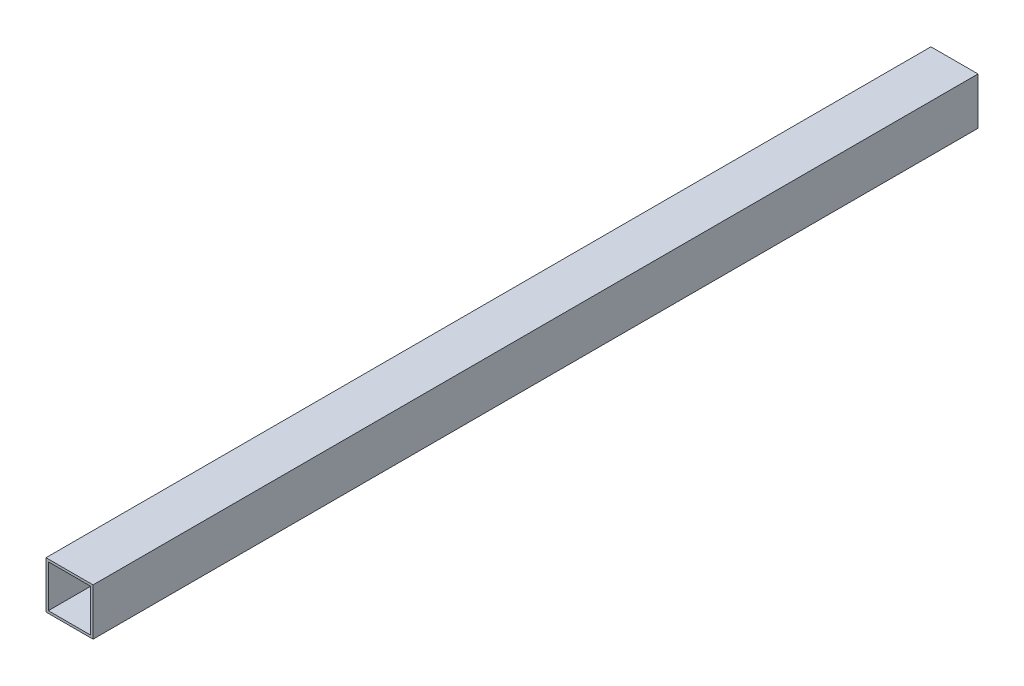
ISO-10303-21;
HEADER;
FILE_DESCRIPTION(('STEP AP214'),'2;1');
FILE_NAME('part.step','',(''),(''),'','','');
FILE_SCHEMA(('AUTOMOTIVE_DESIGN { 1 0 10303 214 1 1 1 1 }'));
ENDSEC;
DATA;
#1=APPLICATION_CONTEXT('core data for automotive mechanical design processes');
#2=APPLICATION_PROTOCOL_DEFINITION('international standard','automotive_design',2000,#1);
#3=PRODUCT_CONTEXT('',#1,'mechanical');
#4=PRODUCT('Part','Part','',(#3));
#5=PRODUCT_RELATED_PRODUCT_CATEGORY('part','',(#4));
#6=PRODUCT_DEFINITION_FORMATION('','',#4);
#7=PRODUCT_DEFINITION_CONTEXT('part definition',#1,'design');
#8=PRODUCT_DEFINITION('design','',#6,#7);
#9=PRODUCT_DEFINITION_SHAPE('','',#8);
#10=(LENGTH_UNIT() NAMED_UNIT(*) SI_UNIT(.MILLI.,.METRE.));
#11=(NAMED_UNIT(*) PLANE_ANGLE_UNIT() SI_UNIT($,.RADIAN.));
#12=(NAMED_UNIT(*) SI_UNIT($,.STERADIAN.) SOLID_ANGLE_UNIT());
#13=UNCERTAINTY_MEASURE_WITH_UNIT(LENGTH_MEASURE(1.E-05),#10,'distance_accuracy_value','');
#14=(GEOMETRIC_REPRESENTATION_CONTEXT(3) GLOBAL_UNCERTAINTY_ASSIGNED_CONTEXT((#13)) GLOBAL_UNIT_ASSIGNED_CONTEXT((#10,
#11,#12)) REPRESENTATION_CONTEXT('',''));
#15=CARTESIAN_POINT('',(0.,0.,0.));
#16=DIRECTION('',(0.,0.,1.));
#17=DIRECTION('',(1.,0.,0.));
#18=AXIS2_PLACEMENT_3D('',#15,#16,#17);
#19=CARTESIAN_POINT('',(0.,0.,940.));
#20=DIRECTION('',(0.,0.,-1.));
#21=DIRECTION('',(-1.,0.,0.));
#22=AXIS2_PLACEMENT_3D('',#19,#20,#21);
#23=PLANE('',#22);
#24=DIRECTION('',(0.,-1.,0.));
#25=VECTOR('',#24,1.);
#26=CARTESIAN_POINT('',(-50.,-50.,940.));
#27=LINE('',#26,#25);
#28=CARTESIAN_POINT('',(-50.,49.9999999999999,940.));
#29=VERTEX_POINT('',#28);
#30=CARTESIAN_POINT('',(-50.,-50.,940.));
#31=VERTEX_POINT('',#30);
#32=EDGE_CURVE('E139',#29,#31,#27,.T.);
#33=ORIENTED_EDGE('',*,*,#32,.T.);
#34=DIRECTION('',(1.,0.,0.));
#35=VECTOR('',#34,1.);
#36=CARTESIAN_POINT('',(-50.,-50.,940.));
#37=LINE('',#36,#35);
#38=CARTESIAN_POINT('',(50.,-50.,940.));
#39=VERTEX_POINT('',#38);
#40=EDGE_CURVE('E141',#31,#39,#37,.T.);
#41=ORIENTED_EDGE('',*,*,#40,.T.);
#42=DIRECTION('',(0.,1.,0.));
#43=VECTOR('',#42,1.);
#44=CARTESIAN_POINT('',(50.,-50.,940.));
#45=LINE('',#44,#43);
#46=CARTESIAN_POINT('',(49.9999999999999,49.9999999999999,940.));
#47=VERTEX_POINT('',#46);
#48=EDGE_CURVE('E148',#39,#47,#45,.T.);
#49=ORIENTED_EDGE('',*,*,#48,.T.);
#50=DIRECTION('',(-1.,0.,0.));
#51=VECTOR('',#50,1.);
#52=CARTESIAN_POINT('',(-50.,49.9999999999999,940.));
#53=LINE('',#52,#51);
#54=EDGE_CURVE('E146',#47,#29,#53,.T.);
#55=ORIENTED_EDGE('',*,*,#54,.T.);
#56=EDGE_LOOP('',(#33,#41,#49,#55));
#57=FACE_BOUND('',#56,.T.);
#58=DIRECTION('',(0.,-1.,0.));
#59=VECTOR('',#58,1.);
#60=CARTESIAN_POINT('',(-45.,-45.,940.));
#61=LINE('',#60,#59);
#62=CARTESIAN_POINT('',(-45.,44.9999999999999,940.));
#63=VERTEX_POINT('',#62);
#64=CARTESIAN_POINT('',(-45.,-45.,940.));
#65=VERTEX_POINT('',#64);
#66=EDGE_CURVE('E102',#63,#65,#61,.T.);
#67=ORIENTED_EDGE('',*,*,#66,.F.);
#68=DIRECTION('',(-1.,0.,0.));
#69=VECTOR('',#68,1.);
#70=CARTESIAN_POINT('',(-45.,44.9999999999999,940.));
#71=LINE('',#70,#69);
#72=CARTESIAN_POINT('',(45.,44.9999999999999,940.));
#73=VERTEX_POINT('',#72);
#74=EDGE_CURVE('E127',#73,#63,#71,.T.);
#75=ORIENTED_EDGE('',*,*,#74,.F.);
#76=DIRECTION('',(0.,1.,0.));
#77=VECTOR('',#76,1.);
#78=CARTESIAN_POINT('',(45.,-45.,940.));
#79=LINE('',#78,#77);
#80=CARTESIAN_POINT('',(45.,-45.,940.));
#81=VERTEX_POINT('',#80);
#82=EDGE_CURVE('E121',#81,#73,#79,.T.);
#83=ORIENTED_EDGE('',*,*,#82,.F.);
#84=DIRECTION('',(1.,0.,0.));
#85=VECTOR('',#84,1.);
#86=CARTESIAN_POINT('',(-45.,-45.,940.));
#87=LINE('',#86,#85);
#88=EDGE_CURVE('E115',#65,#81,#87,.T.);
#89=ORIENTED_EDGE('',*,*,#88,.F.);
#90=EDGE_LOOP('',(#67,#75,#83,#89));
#91=FACE_BOUND('',#90,.T.);
#92=ADVANCED_FACE('F39',(#57,#91),#23,.F.);
#93=CARTESIAN_POINT('',(0.,0.,-940.));
#94=DIRECTION('',(0.,0.,-1.));
#95=DIRECTION('',(-1.,0.,0.));
#96=AXIS2_PLACEMENT_3D('',#93,#94,#95);
#97=PLANE('',#96);
#98=DIRECTION('',(0.,-1.,0.));
#99=VECTOR('',#98,1.);
#100=CARTESIAN_POINT('',(-50.,-50.,-940.));
#101=LINE('',#100,#99);
#102=CARTESIAN_POINT('',(-50.,49.9999999999999,-940.));
#103=VERTEX_POINT('',#102);
#104=CARTESIAN_POINT('',(-50.,-50.,-940.));
#105=VERTEX_POINT('',#104);
#106=EDGE_CURVE('E118',#103,#105,#101,.T.);
#107=ORIENTED_EDGE('',*,*,#106,.F.);
#108=DIRECTION('',(-1.,0.,0.));
#109=VECTOR('',#108,1.);
#110=CARTESIAN_POINT('',(-50.,49.9999999999999,-940.));
#111=LINE('',#110,#109);
#112=CARTESIAN_POINT('',(49.9999999999999,49.9999999999999,-940.));
#113=VERTEX_POINT('',#112);
#114=EDGE_CURVE('E145',#113,#103,#111,.T.);
#115=ORIENTED_EDGE('',*,*,#114,.F.);
#116=DIRECTION('',(0.,1.,0.));
#117=VECTOR('',#116,1.);
#118=CARTESIAN_POINT('',(50.,-50.,-940.));
#119=LINE('',#118,#117);
#120=CARTESIAN_POINT('',(50.,-50.,-940.));
#121=VERTEX_POINT('',#120);
#122=EDGE_CURVE('E154',#121,#113,#119,.T.);
#123=ORIENTED_EDGE('',*,*,#122,.F.);
#124=DIRECTION('',(1.,0.,0.));
#125=VECTOR('',#124,1.);
#126=CARTESIAN_POINT('',(-50.,-50.,-940.));
#127=LINE('',#126,#125);
#128=EDGE_CURVE('E153',#105,#121,#127,.T.);
#129=ORIENTED_EDGE('',*,*,#128,.F.);
#130=EDGE_LOOP('',(#107,#115,#123,#129));
#131=FACE_BOUND('',#130,.T.);
#132=DIRECTION('',(-1.,0.,0.));
#133=VECTOR('',#132,1.);
#134=CARTESIAN_POINT('',(-45.,44.9999999999999,-940.));
#135=LINE('',#134,#133);
#136=CARTESIAN_POINT('',(45.,44.9999999999999,-940.));
#137=VERTEX_POINT('',#136);
#138=CARTESIAN_POINT('',(-45.,44.9999999999999,-940.));
#139=VERTEX_POINT('',#138);
#140=EDGE_CURVE('E114',#137,#139,#135,.T.);
#141=ORIENTED_EDGE('',*,*,#140,.T.);
#142=DIRECTION('',(0.,-1.,0.));
#143=VECTOR('',#142,1.);
#144=CARTESIAN_POINT('',(-45.,-45.,-940.));
#145=LINE('',#144,#143);
#146=CARTESIAN_POINT('',(-45.,-45.,-940.));
#147=VERTEX_POINT('',#146);
#148=EDGE_CURVE('E65',#139,#147,#145,.T.);
#149=ORIENTED_EDGE('',*,*,#148,.T.);
#150=DIRECTION('',(1.,0.,0.));
#151=VECTOR('',#150,1.);
#152=CARTESIAN_POINT('',(-45.,-45.,-940.));
#153=LINE('',#152,#151);
#154=CARTESIAN_POINT('',(45.,-45.,-940.));
#155=VERTEX_POINT('',#154);
#156=EDGE_CURVE('E116',#147,#155,#153,.T.);
#157=ORIENTED_EDGE('',*,*,#156,.T.);
#158=DIRECTION('',(0.,1.,0.));
#159=VECTOR('',#158,1.);
#160=CARTESIAN_POINT('',(45.,-45.,-940.));
#161=LINE('',#160,#159);
#162=EDGE_CURVE('E135',#155,#137,#161,.T.);
#163=ORIENTED_EDGE('',*,*,#162,.T.);
#164=EDGE_LOOP('',(#141,#149,#157,#163));
#165=FACE_BOUND('',#164,.T.);
#166=ADVANCED_FACE('F174',(#131,#165),#97,.T.);
#167=CARTESIAN_POINT('',(-50.,-50.,940.));
#168=DIRECTION('',(1.,0.,0.));
#169=DIRECTION('',(0.,0.,-1.));
#170=AXIS2_PLACEMENT_3D('',#167,#168,#169);
#171=PLANE('',#170);
#172=ORIENTED_EDGE('',*,*,#106,.T.);
#173=DIRECTION('',(0.,0.,-1.));
#174=VECTOR('',#173,1.);
#175=CARTESIAN_POINT('',(-50.,-50.,940.));
#176=LINE('',#175,#174);
#177=EDGE_CURVE('E11',#31,#105,#176,.T.);
#178=ORIENTED_EDGE('',*,*,#177,.F.);
#179=ORIENTED_EDGE('',*,*,#32,.F.);
#180=DIRECTION('',(0.,0.,-1.));
#181=VECTOR('',#180,1.);
#182=CARTESIAN_POINT('',(-50.,49.9999999999999,940.));
#183=LINE('',#182,#181);
#184=EDGE_CURVE('E147',#29,#103,#183,.T.);
#185=ORIENTED_EDGE('',*,*,#184,.T.);
#186=EDGE_LOOP('',(#172,#178,#179,#185));
#187=FACE_BOUND('',#186,.T.);
#188=ADVANCED_FACE('F41',(#187),#171,.F.);
#189=CARTESIAN_POINT('',(-50.,-50.,940.));
#190=DIRECTION('',(0.,1.,0.));
#191=DIRECTION('',(0.,0.,1.));
#192=AXIS2_PLACEMENT_3D('',#189,#190,#191);
#193=PLANE('',#192);
#194=ORIENTED_EDGE('',*,*,#128,.T.);
#195=DIRECTION('',(0.,0.,-1.));
#196=VECTOR('',#195,1.);
#197=CARTESIAN_POINT('',(50.,-50.,940.));
#198=LINE('',#197,#196);
#199=EDGE_CURVE('E50',#39,#121,#198,.T.);
#200=ORIENTED_EDGE('',*,*,#199,.F.);
#201=ORIENTED_EDGE('',*,*,#40,.F.);
#202=ORIENTED_EDGE('',*,*,#177,.T.);
#203=EDGE_LOOP('',(#194,#200,#201,#202));
#204=FACE_BOUND('',#203,.T.);
#205=ADVANCED_FACE('F181',(#204),#193,.F.);
#206=CARTESIAN_POINT('',(50.,-50.,940.));
#207=DIRECTION('',(-1.,0.,0.));
#208=DIRECTION('',(0.,-1.,0.));
#209=AXIS2_PLACEMENT_3D('',#206,#207,#208);
#210=PLANE('',#209);
#211=ORIENTED_EDGE('',*,*,#122,.T.);
#212=DIRECTION('',(0.,0.,-1.));
#213=VECTOR('',#212,1.);
#214=CARTESIAN_POINT('',(49.9999999999999,49.9999999999999,940.));
#215=LINE('',#214,#213);
#216=EDGE_CURVE('E159',#47,#113,#215,.T.);
#217=ORIENTED_EDGE('',*,*,#216,.F.);
#218=ORIENTED_EDGE('',*,*,#48,.F.);
#219=ORIENTED_EDGE('',*,*,#199,.T.);
#220=EDGE_LOOP('',(#211,#217,#218,#219));
#221=FACE_BOUND('',#220,.T.);
#222=ADVANCED_FACE('F170',(#221),#210,.F.);
#223=CARTESIAN_POINT('',(-50.,49.9999999999999,940.));
#224=DIRECTION('',(0.,-1.,0.));
#225=DIRECTION('',(0.,0.,-1.));
#226=AXIS2_PLACEMENT_3D('',#223,#224,#225);
#227=PLANE('',#226);
#228=ORIENTED_EDGE('',*,*,#114,.T.);
#229=ORIENTED_EDGE('',*,*,#184,.F.);
#230=ORIENTED_EDGE('',*,*,#54,.F.);
#231=ORIENTED_EDGE('',*,*,#216,.T.);
#232=EDGE_LOOP('',(#228,#229,#230,#231));
#233=FACE_BOUND('',#232,.T.);
#234=ADVANCED_FACE('F180',(#233),#227,.F.);
#235=CARTESIAN_POINT('',(-45.,-45.,940.));
#236=DIRECTION('',(1.,0.,0.));
#237=DIRECTION('',(0.,0.,-1.));
#238=AXIS2_PLACEMENT_3D('',#235,#236,#237);
#239=PLANE('',#238);
#240=ORIENTED_EDGE('',*,*,#148,.F.);
#241=DIRECTION('',(0.,0.,-1.));
#242=VECTOR('',#241,1.);
#243=CARTESIAN_POINT('',(-45.,44.9999999999999,940.));
#244=LINE('',#243,#242);
#245=EDGE_CURVE('E107',#63,#139,#244,.T.);
#246=ORIENTED_EDGE('',*,*,#245,.F.);
#247=ORIENTED_EDGE('',*,*,#66,.T.);
#248=DIRECTION('',(0.,0.,-1.));
#249=VECTOR('',#248,1.);
#250=CARTESIAN_POINT('',(-45.,-45.,940.));
#251=LINE('',#250,#249);
#252=EDGE_CURVE('E110',#65,#147,#251,.T.);
#253=ORIENTED_EDGE('',*,*,#252,.T.);
#254=EDGE_LOOP('',(#240,#246,#247,#253));
#255=FACE_BOUND('',#254,.T.);
#256=ADVANCED_FACE('F106',(#255),#239,.T.);
#257=CARTESIAN_POINT('',(-45.,-45.,940.));
#258=DIRECTION('',(0.,1.,0.));
#259=DIRECTION('',(0.,0.,1.));
#260=AXIS2_PLACEMENT_3D('',#257,#258,#259);
#261=PLANE('',#260);
#262=ORIENTED_EDGE('',*,*,#156,.F.);
#263=ORIENTED_EDGE('',*,*,#252,.F.);
#264=ORIENTED_EDGE('',*,*,#88,.T.);
#265=DIRECTION('',(0.,0.,-1.));
#266=VECTOR('',#265,1.);
#267=CARTESIAN_POINT('',(45.,-45.,940.));
#268=LINE('',#267,#266);
#269=EDGE_CURVE('E122',#81,#155,#268,.T.);
#270=ORIENTED_EDGE('',*,*,#269,.T.);
#271=EDGE_LOOP('',(#262,#263,#264,#270));
#272=FACE_BOUND('',#271,.T.);
#273=ADVANCED_FACE('F117',(#272),#261,.T.);
#274=CARTESIAN_POINT('',(45.,-45.,940.));
#275=DIRECTION('',(-1.,0.,0.));
#276=DIRECTION('',(0.,-1.,0.));
#277=AXIS2_PLACEMENT_3D('',#274,#275,#276);
#278=PLANE('',#277);
#279=ORIENTED_EDGE('',*,*,#162,.F.);
#280=ORIENTED_EDGE('',*,*,#269,.F.);
#281=ORIENTED_EDGE('',*,*,#82,.T.);
#282=DIRECTION('',(0.,0.,-1.));
#283=VECTOR('',#282,1.);
#284=CARTESIAN_POINT('',(45.,44.9999999999999,940.));
#285=LINE('',#284,#283);
#286=EDGE_CURVE('E53',#73,#137,#285,.T.);
#287=ORIENTED_EDGE('',*,*,#286,.T.);
#288=EDGE_LOOP('',(#279,#280,#281,#287));
#289=FACE_BOUND('',#288,.T.);
#290=ADVANCED_FACE('F206',(#289),#278,.T.);
#291=CARTESIAN_POINT('',(-45.,44.9999999999999,940.));
#292=DIRECTION('',(0.,-1.,0.));
#293=DIRECTION('',(0.,0.,-1.));
#294=AXIS2_PLACEMENT_3D('',#291,#292,#293);
#295=PLANE('',#294);
#296=ORIENTED_EDGE('',*,*,#140,.F.);
#297=ORIENTED_EDGE('',*,*,#286,.F.);
#298=ORIENTED_EDGE('',*,*,#74,.T.);
#299=ORIENTED_EDGE('',*,*,#245,.T.);
#300=EDGE_LOOP('',(#296,#297,#298,#299));
#301=FACE_BOUND('',#300,.T.);
#302=ADVANCED_FACE('F209',(#301),#295,.T.);
#303=CLOSED_SHELL('',(#92,#166,#188,#205,#222,#234,#256,#273,#290,#302));
#304=MANIFOLD_SOLID_BREP('B2',#303);
#305=ADVANCED_BREP_SHAPE_REPRESENTATION('',(#18,#304),#14);
#306=SHAPE_DEFINITION_REPRESENTATION(#9,#305);
ENDSEC;
END-ISO-10303-21;
